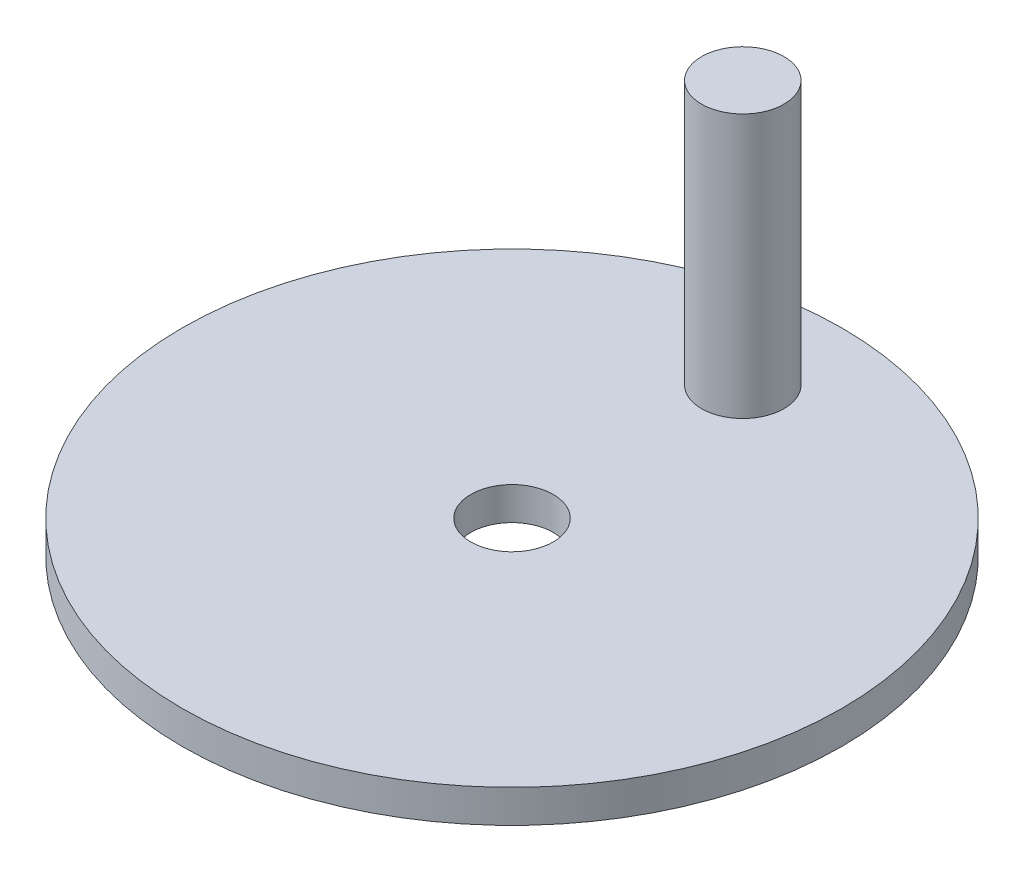
ISO-10303-21;
HEADER;
FILE_DESCRIPTION(('STEP AP214'),'2;1');
FILE_NAME('part.step','',(''),(''),'','','');
FILE_SCHEMA(('AUTOMOTIVE_DESIGN { 1 0 10303 214 1 1 1 1 }'));
ENDSEC;
DATA;
#1=APPLICATION_CONTEXT('core data for automotive mechanical design processes');
#2=APPLICATION_PROTOCOL_DEFINITION('international standard','automotive_design',2000,#1);
#3=PRODUCT_CONTEXT('',#1,'mechanical');
#4=PRODUCT('Part','Part','',(#3));
#5=PRODUCT_RELATED_PRODUCT_CATEGORY('part','',(#4));
#6=PRODUCT_DEFINITION_FORMATION('','',#4);
#7=PRODUCT_DEFINITION_CONTEXT('part definition',#1,'design');
#8=PRODUCT_DEFINITION('design','',#6,#7);
#9=PRODUCT_DEFINITION_SHAPE('','',#8);
#10=(LENGTH_UNIT() NAMED_UNIT(*) SI_UNIT(.MILLI.,.METRE.));
#11=(NAMED_UNIT(*) PLANE_ANGLE_UNIT() SI_UNIT($,.RADIAN.));
#12=(NAMED_UNIT(*) SI_UNIT($,.STERADIAN.) SOLID_ANGLE_UNIT());
#13=UNCERTAINTY_MEASURE_WITH_UNIT(LENGTH_MEASURE(1.E-05),#10,'distance_accuracy_value','');
#14=(GEOMETRIC_REPRESENTATION_CONTEXT(3) GLOBAL_UNCERTAINTY_ASSIGNED_CONTEXT((#13)) GLOBAL_UNIT_ASSIGNED_CONTEXT((#10,
#11,#12)) REPRESENTATION_CONTEXT('',''));
#15=CARTESIAN_POINT('',(0.,0.,0.));
#16=DIRECTION('',(0.,0.,1.));
#17=DIRECTION('',(1.,0.,0.));
#18=AXIS2_PLACEMENT_3D('',#15,#16,#17);
#19=CARTESIAN_POINT('',(0.,2.54,0.));
#20=DIRECTION('',(0.,1.,0.));
#21=DIRECTION('',(0.,0.,1.));
#22=AXIS2_PLACEMENT_3D('',#19,#20,#21);
#23=PLANE('',#22);
#24=CARTESIAN_POINT('',(0.,2.54,-17.78));
#25=DIRECTION('',(0.,1.,0.));
#26=DIRECTION('',(0.,0.,1.));
#27=AXIS2_PLACEMENT_3D('',#24,#25,#26);
#28=CIRCLE('',#27,3.175);
#29=CARTESIAN_POINT('',(0.,2.54,-14.605));
#30=VERTEX_POINT('',#29);
#31=EDGE_CURVE('E54',#30,#30,#28,.T.);
#32=ORIENTED_EDGE('',*,*,#31,.F.);
#33=EDGE_LOOP('',(#32));
#34=FACE_BOUND('',#33,.T.);
#35=CARTESIAN_POINT('',(0.,2.54,0.));
#36=DIRECTION('',(0.,1.,0.));
#37=DIRECTION('',(0.,0.,1.));
#38=AXIS2_PLACEMENT_3D('',#35,#36,#37);
#39=CIRCLE('',#38,25.4);
#40=CARTESIAN_POINT('',(0.,2.54,25.4));
#41=VERTEX_POINT('',#40);
#42=EDGE_CURVE('E10',#41,#41,#39,.T.);
#43=ORIENTED_EDGE('',*,*,#42,.T.);
#44=EDGE_LOOP('',(#43));
#45=FACE_BOUND('',#44,.T.);
#46=CARTESIAN_POINT('',(0.,2.54,0.));
#47=DIRECTION('',(0.,1.,0.));
#48=DIRECTION('',(0.,0.,1.));
#49=AXIS2_PLACEMENT_3D('',#46,#47,#48);
#50=CIRCLE('',#49,3.175);
#51=CARTESIAN_POINT('',(0.,2.54,3.175));
#52=VERTEX_POINT('',#51);
#53=EDGE_CURVE('E46',#52,#52,#50,.T.);
#54=ORIENTED_EDGE('',*,*,#53,.F.);
#55=EDGE_LOOP('',(#54));
#56=FACE_BOUND('',#55,.T.);
#57=ADVANCED_FACE('F35',(#34,#45,#56),#23,.T.);
#58=CARTESIAN_POINT('',(0.,0.,0.));
#59=DIRECTION('',(0.,1.,0.));
#60=DIRECTION('',(0.,0.,1.));
#61=AXIS2_PLACEMENT_3D('',#58,#59,#60);
#62=PLANE('',#61);
#63=CARTESIAN_POINT('',(0.,0.,0.));
#64=DIRECTION('',(0.,1.,0.));
#65=DIRECTION('',(0.,0.,1.));
#66=AXIS2_PLACEMENT_3D('',#63,#64,#65);
#67=CIRCLE('',#66,25.4);
#68=CARTESIAN_POINT('',(0.,0.,25.4));
#69=VERTEX_POINT('',#68);
#70=EDGE_CURVE('E39',#69,#69,#67,.T.);
#71=ORIENTED_EDGE('',*,*,#70,.F.);
#72=EDGE_LOOP('',(#71));
#73=FACE_BOUND('',#72,.T.);
#74=CARTESIAN_POINT('',(0.,0.,0.));
#75=DIRECTION('',(0.,1.,0.));
#76=DIRECTION('',(0.,0.,1.));
#77=AXIS2_PLACEMENT_3D('',#74,#75,#76);
#78=CIRCLE('',#77,3.175);
#79=CARTESIAN_POINT('',(0.,0.,3.175));
#80=VERTEX_POINT('',#79);
#81=EDGE_CURVE('E48',#80,#80,#78,.T.);
#82=ORIENTED_EDGE('',*,*,#81,.T.);
#83=EDGE_LOOP('',(#82));
#84=FACE_BOUND('',#83,.T.);
#85=ADVANCED_FACE('F70',(#73,#84),#62,.F.);
#86=CARTESIAN_POINT('',(0.,2.54,0.));
#87=DIRECTION('',(0.,-1.,0.));
#88=DIRECTION('',(0.,0.,-1.));
#89=AXIS2_PLACEMENT_3D('',#86,#87,#88);
#90=CYLINDRICAL_SURFACE('',#89,25.4);
#91=ORIENTED_EDGE('',*,*,#42,.F.);
#92=EDGE_LOOP('',(#91));
#93=FACE_BOUND('',#92,.T.);
#94=ORIENTED_EDGE('',*,*,#70,.T.);
#95=EDGE_LOOP('',(#94));
#96=FACE_BOUND('',#95,.T.);
#97=ADVANCED_FACE('F37',(#93,#96),#90,.T.);
#98=CARTESIAN_POINT('',(0.,2.54,0.));
#99=DIRECTION('',(0.,-1.,0.));
#100=DIRECTION('',(0.,0.,-1.));
#101=AXIS2_PLACEMENT_3D('',#98,#99,#100);
#102=CYLINDRICAL_SURFACE('',#101,3.175);
#103=ORIENTED_EDGE('',*,*,#53,.T.);
#104=EDGE_LOOP('',(#103));
#105=FACE_BOUND('',#104,.T.);
#106=ORIENTED_EDGE('',*,*,#81,.F.);
#107=EDGE_LOOP('',(#106));
#108=FACE_BOUND('',#107,.T.);
#109=ADVANCED_FACE('F65',(#105,#108),#102,.F.);
#110=CARTESIAN_POINT('',(0.,22.86,-17.78));
#111=DIRECTION('',(0.,-1.,0.));
#112=DIRECTION('',(0.,0.,-1.));
#113=AXIS2_PLACEMENT_3D('',#110,#111,#112);
#114=CYLINDRICAL_SURFACE('',#113,3.175);
#115=CARTESIAN_POINT('',(0.,22.86,-17.78));
#116=DIRECTION('',(0.,1.,0.));
#117=DIRECTION('',(0.,0.,1.));
#118=AXIS2_PLACEMENT_3D('',#115,#116,#117);
#119=CIRCLE('',#118,3.175);
#120=CARTESIAN_POINT('',(0.,22.86,-14.605));
#121=VERTEX_POINT('',#120);
#122=EDGE_CURVE('E51',#121,#121,#119,.T.);
#123=ORIENTED_EDGE('',*,*,#122,.F.);
#124=EDGE_LOOP('',(#123));
#125=FACE_BOUND('',#124,.T.);
#126=ORIENTED_EDGE('',*,*,#31,.T.);
#127=EDGE_LOOP('',(#126));
#128=FACE_BOUND('',#127,.T.);
#129=ADVANCED_FACE('F62',(#125,#128),#114,.T.);
#130=CARTESIAN_POINT('',(0.,22.86,-17.78));
#131=DIRECTION('',(0.,1.,0.));
#132=DIRECTION('',(0.,0.,1.));
#133=AXIS2_PLACEMENT_3D('',#130,#131,#132);
#134=PLANE('',#133);
#135=ORIENTED_EDGE('',*,*,#122,.T.);
#136=EDGE_LOOP('',(#135));
#137=FACE_BOUND('',#136,.T.);
#138=ADVANCED_FACE('F60',(#137),#134,.T.);
#139=CLOSED_SHELL('',(#57,#85,#97,#109,#129,#138));
#140=MANIFOLD_SOLID_BREP('B2',#139);
#141=ADVANCED_BREP_SHAPE_REPRESENTATION('',(#18,#140),#14);
#142=SHAPE_DEFINITION_REPRESENTATION(#9,#141);
ENDSEC;
END-ISO-10303-21;
